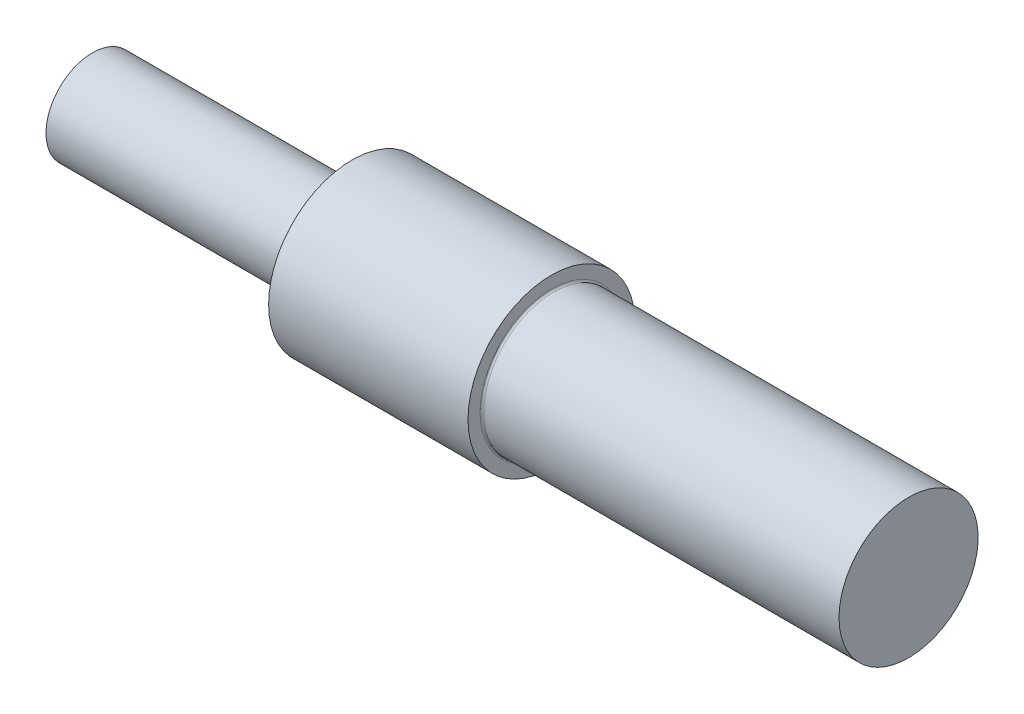
ISO-10303-21;
HEADER;
FILE_DESCRIPTION(('STEP AP214'),'2;1');
FILE_NAME('part.step','',(''),(''),'','','');
FILE_SCHEMA(('AUTOMOTIVE_DESIGN { 1 0 10303 214 1 1 1 1 }'));
ENDSEC;
DATA;
#1=APPLICATION_CONTEXT('core data for automotive mechanical design processes');
#2=APPLICATION_PROTOCOL_DEFINITION('international standard','automotive_design',2000,#1);
#3=PRODUCT_CONTEXT('',#1,'mechanical');
#4=PRODUCT('Part','Part','',(#3));
#5=PRODUCT_RELATED_PRODUCT_CATEGORY('part','',(#4));
#6=PRODUCT_DEFINITION_FORMATION('','',#4);
#7=PRODUCT_DEFINITION_CONTEXT('part definition',#1,'design');
#8=PRODUCT_DEFINITION('design','',#6,#7);
#9=PRODUCT_DEFINITION_SHAPE('','',#8);
#10=(LENGTH_UNIT() NAMED_UNIT(*) SI_UNIT(.MILLI.,.METRE.));
#11=(NAMED_UNIT(*) PLANE_ANGLE_UNIT() SI_UNIT($,.RADIAN.));
#12=(NAMED_UNIT(*) SI_UNIT($,.STERADIAN.) SOLID_ANGLE_UNIT());
#13=UNCERTAINTY_MEASURE_WITH_UNIT(LENGTH_MEASURE(1.E-05),#10,'distance_accuracy_value','');
#14=(GEOMETRIC_REPRESENTATION_CONTEXT(3) GLOBAL_UNCERTAINTY_ASSIGNED_CONTEXT((#13)) GLOBAL_UNIT_ASSIGNED_CONTEXT((#10,
#11,#12)) REPRESENTATION_CONTEXT('',''));
#15=CARTESIAN_POINT('',(0.,0.,0.));
#16=DIRECTION('',(0.,0.,1.));
#17=DIRECTION('',(1.,0.,0.));
#18=AXIS2_PLACEMENT_3D('',#15,#16,#17);
#19=CARTESIAN_POINT('',(-0.5,0.,0.));
#20=DIRECTION('',(-1.,0.,0.));
#21=DIRECTION('',(0.,0.,1.));
#22=AXIS2_PLACEMENT_3D('',#19,#20,#21);
#23=TOROIDAL_SURFACE('',#22,5.,0.5);
#24=CARTESIAN_POINT('',(-1.,0.,0.));
#25=DIRECTION('',(-1.,0.,0.));
#26=DIRECTION('',(0.,0.,1.));
#27=AXIS2_PLACEMENT_3D('',#24,#25,#26);
#28=CIRCLE('',#27,5.);
#29=CARTESIAN_POINT('',(-1.,0.,5.));
#30=VERTEX_POINT('',#29);
#31=EDGE_CURVE('E10',#30,#30,#28,.T.);
#32=ORIENTED_EDGE('',*,*,#31,.F.);
#33=EDGE_LOOP('',(#32));
#34=FACE_BOUND('',#33,.T.);
#35=CARTESIAN_POINT('',(0.,0.,0.));
#36=DIRECTION('',(-1.,0.,0.));
#37=DIRECTION('',(0.,0.,1.));
#38=AXIS2_PLACEMENT_3D('',#35,#36,#37);
#39=CIRCLE('',#38,5.);
#40=CARTESIAN_POINT('',(0.,0.,5.));
#41=VERTEX_POINT('',#40);
#42=EDGE_CURVE('E59',#41,#41,#39,.T.);
#43=ORIENTED_EDGE('',*,*,#42,.T.);
#44=EDGE_LOOP('',(#43));
#45=FACE_BOUND('',#44,.T.);
#46=ADVANCED_FACE('F31',(#34,#45),#23,.F.);
#47=CARTESIAN_POINT('',(-49.8126510959288,0.,0.));
#48=DIRECTION('',(-1.,0.,0.));
#49=DIRECTION('',(0.,0.,1.));
#50=AXIS2_PLACEMENT_3D('',#47,#48,#49);
#51=CYLINDRICAL_SURFACE('',#50,5.);
#52=CARTESIAN_POINT('',(-28.,0.,0.));
#53=DIRECTION('',(-1.,0.,0.));
#54=DIRECTION('',(0.,0.,1.));
#55=AXIS2_PLACEMENT_3D('',#52,#53,#54);
#56=CIRCLE('',#55,5.);
#57=CARTESIAN_POINT('',(-28.,0.,5.));
#58=VERTEX_POINT('',#57);
#59=EDGE_CURVE('E37',#58,#58,#56,.T.);
#60=ORIENTED_EDGE('',*,*,#59,.F.);
#61=EDGE_LOOP('',(#60));
#62=FACE_BOUND('',#61,.T.);
#63=ORIENTED_EDGE('',*,*,#31,.T.);
#64=EDGE_LOOP('',(#63));
#65=FACE_BOUND('',#64,.T.);
#66=ADVANCED_FACE('F101',(#62,#65),#51,.T.);
#67=CARTESIAN_POINT('',(-28.,5.,0.));
#68=DIRECTION('',(1.,0.,0.));
#69=DIRECTION('',(0.,0.,-1.));
#70=AXIS2_PLACEMENT_3D('',#67,#68,#69);
#71=PLANE('',#70);
#72=ORIENTED_EDGE('',*,*,#59,.T.);
#73=EDGE_LOOP('',(#72));
#74=FACE_BOUND('',#73,.T.);
#75=ADVANCED_FACE('F96',(#74),#71,.F.);
#76=CARTESIAN_POINT('',(60.,0.,0.));
#77=DIRECTION('',(-1.,0.,0.));
#78=DIRECTION('',(0.,0.,1.));
#79=AXIS2_PLACEMENT_3D('',#76,#77,#78);
#80=PLANE('',#79);
#81=CARTESIAN_POINT('',(60.,0.,0.));
#82=DIRECTION('',(-1.,0.,0.));
#83=DIRECTION('',(0.,0.,1.));
#84=AXIS2_PLACEMENT_3D('',#81,#82,#83);
#85=CIRCLE('',#84,7.5);
#86=CARTESIAN_POINT('',(60.,0.,7.5));
#87=VERTEX_POINT('',#86);
#88=EDGE_CURVE('E41',#87,#87,#85,.T.);
#89=ORIENTED_EDGE('',*,*,#88,.F.);
#90=EDGE_LOOP('',(#89));
#91=FACE_BOUND('',#90,.T.);
#92=ADVANCED_FACE('F91',(#91),#80,.F.);
#93=CARTESIAN_POINT('',(-49.8126510959288,0.,0.));
#94=DIRECTION('',(-1.,0.,0.));
#95=DIRECTION('',(0.,0.,1.));
#96=AXIS2_PLACEMENT_3D('',#93,#94,#95);
#97=CYLINDRICAL_SURFACE('',#96,7.5);
#98=CARTESIAN_POINT('',(21.7,0.,0.));
#99=DIRECTION('',(-1.,0.,0.));
#100=DIRECTION('',(0.,0.,1.));
#101=AXIS2_PLACEMENT_3D('',#98,#99,#100);
#102=CIRCLE('',#101,7.5);
#103=CARTESIAN_POINT('',(21.7,0.,7.5));
#104=VERTEX_POINT('',#103);
#105=EDGE_CURVE('E45',#104,#104,#102,.T.);
#106=ORIENTED_EDGE('',*,*,#105,.F.);
#107=EDGE_LOOP('',(#106));
#108=FACE_BOUND('',#107,.T.);
#109=ORIENTED_EDGE('',*,*,#88,.T.);
#110=EDGE_LOOP('',(#109));
#111=FACE_BOUND('',#110,.T.);
#112=ADVANCED_FACE('F85',(#108,#111),#97,.T.);
#113=CARTESIAN_POINT('',(21.7,0.,0.));
#114=DIRECTION('',(-1.,0.,0.));
#115=DIRECTION('',(0.,0.,1.));
#116=AXIS2_PLACEMENT_3D('',#113,#114,#115);
#117=TOROIDAL_SURFACE('',#116,7.7,0.199999999999999);
#118=CARTESIAN_POINT('',(21.5,0.,0.));
#119=DIRECTION('',(-1.,0.,0.));
#120=DIRECTION('',(0.,0.,1.));
#121=AXIS2_PLACEMENT_3D('',#118,#119,#120);
#122=CIRCLE('',#121,7.7);
#123=CARTESIAN_POINT('',(21.5,0.,7.7));
#124=VERTEX_POINT('',#123);
#125=EDGE_CURVE('E50',#124,#124,#122,.T.);
#126=ORIENTED_EDGE('',*,*,#125,.F.);
#127=EDGE_LOOP('',(#126));
#128=FACE_BOUND('',#127,.T.);
#129=ORIENTED_EDGE('',*,*,#105,.T.);
#130=EDGE_LOOP('',(#129));
#131=FACE_BOUND('',#130,.T.);
#132=ADVANCED_FACE('F79',(#128,#131),#117,.F.);
#133=CARTESIAN_POINT('',(21.5,9.,0.));
#134=DIRECTION('',(-1.,0.,0.));
#135=DIRECTION('',(0.,0.,1.));
#136=AXIS2_PLACEMENT_3D('',#133,#134,#135);
#137=PLANE('',#136);
#138=CARTESIAN_POINT('',(21.5,0.,0.));
#139=DIRECTION('',(-1.,0.,0.));
#140=DIRECTION('',(0.,0.,1.));
#141=AXIS2_PLACEMENT_3D('',#138,#139,#140);
#142=CIRCLE('',#141,9.);
#143=CARTESIAN_POINT('',(21.5,0.,9.));
#144=VERTEX_POINT('',#143);
#145=EDGE_CURVE('E53',#144,#144,#142,.T.);
#146=ORIENTED_EDGE('',*,*,#145,.F.);
#147=EDGE_LOOP('',(#146));
#148=FACE_BOUND('',#147,.T.);
#149=ORIENTED_EDGE('',*,*,#125,.T.);
#150=EDGE_LOOP('',(#149));
#151=FACE_BOUND('',#150,.T.);
#152=ADVANCED_FACE('F73',(#148,#151),#137,.F.);
#153=CARTESIAN_POINT('',(-49.8126510959288,0.,0.));
#154=DIRECTION('',(-1.,0.,0.));
#155=DIRECTION('',(0.,0.,1.));
#156=AXIS2_PLACEMENT_3D('',#153,#154,#155);
#157=CYLINDRICAL_SURFACE('',#156,9.);
#158=CARTESIAN_POINT('',(0.,0.,0.));
#159=DIRECTION('',(-1.,0.,0.));
#160=DIRECTION('',(0.,0.,1.));
#161=AXIS2_PLACEMENT_3D('',#158,#159,#160);
#162=CIRCLE('',#161,8.99999999999999);
#163=CARTESIAN_POINT('',(0.,0.,8.99999999999999));
#164=VERTEX_POINT('',#163);
#165=EDGE_CURVE('E56',#164,#164,#162,.T.);
#166=ORIENTED_EDGE('',*,*,#165,.F.);
#167=EDGE_LOOP('',(#166));
#168=FACE_BOUND('',#167,.T.);
#169=ORIENTED_EDGE('',*,*,#145,.T.);
#170=EDGE_LOOP('',(#169));
#171=FACE_BOUND('',#170,.T.);
#172=ADVANCED_FACE('F67',(#168,#171),#157,.T.);
#173=CARTESIAN_POINT('',(0.,8.99999999999999,0.));
#174=DIRECTION('',(1.,0.,0.));
#175=DIRECTION('',(0.,0.,-1.));
#176=AXIS2_PLACEMENT_3D('',#173,#174,#175);
#177=PLANE('',#176);
#178=ORIENTED_EDGE('',*,*,#42,.F.);
#179=EDGE_LOOP('',(#178));
#180=FACE_BOUND('',#179,.T.);
#181=ORIENTED_EDGE('',*,*,#165,.T.);
#182=EDGE_LOOP('',(#181));
#183=FACE_BOUND('',#182,.T.);
#184=ADVANCED_FACE('F64',(#180,#183),#177,.F.);
#185=CLOSED_SHELL('',(#46,#66,#75,#92,#112,#132,#152,#172,#184));
#186=MANIFOLD_SOLID_BREP('B2',#185);
#187=ADVANCED_BREP_SHAPE_REPRESENTATION('',(#18,#186),#14);
#188=SHAPE_DEFINITION_REPRESENTATION(#9,#187);
ENDSEC;
END-ISO-10303-21;
